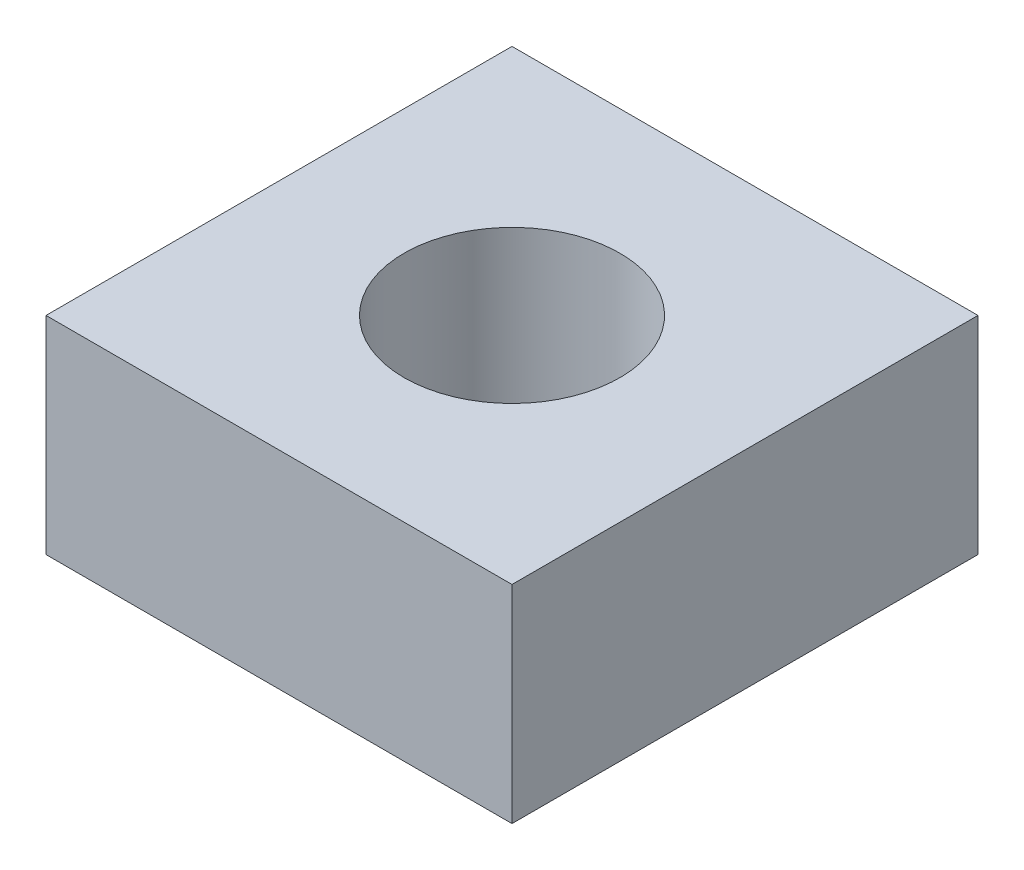
ISO-10303-21;
HEADER;
FILE_DESCRIPTION(('STEP AP214'),'2;1');
FILE_NAME('part.step','',(''),(''),'','','');
FILE_SCHEMA(('AUTOMOTIVE_DESIGN { 1 0 10303 214 1 1 1 1 }'));
ENDSEC;
DATA;
#1=APPLICATION_CONTEXT('core data for automotive mechanical design processes');
#2=APPLICATION_PROTOCOL_DEFINITION('international standard','automotive_design',2000,#1);
#3=PRODUCT_CONTEXT('',#1,'mechanical');
#4=PRODUCT('Part','Part','',(#3));
#5=PRODUCT_RELATED_PRODUCT_CATEGORY('part','',(#4));
#6=PRODUCT_DEFINITION_FORMATION('','',#4);
#7=PRODUCT_DEFINITION_CONTEXT('part definition',#1,'design');
#8=PRODUCT_DEFINITION('design','',#6,#7);
#9=PRODUCT_DEFINITION_SHAPE('','',#8);
#10=(LENGTH_UNIT() NAMED_UNIT(*) SI_UNIT(.MILLI.,.METRE.));
#11=(NAMED_UNIT(*) PLANE_ANGLE_UNIT() SI_UNIT($,.RADIAN.));
#12=(NAMED_UNIT(*) SI_UNIT($,.STERADIAN.) SOLID_ANGLE_UNIT());
#13=UNCERTAINTY_MEASURE_WITH_UNIT(LENGTH_MEASURE(1.E-05),#10,'distance_accuracy_value','');
#14=(GEOMETRIC_REPRESENTATION_CONTEXT(3) GLOBAL_UNCERTAINTY_ASSIGNED_CONTEXT((#13)) GLOBAL_UNIT_ASSIGNED_CONTEXT((#10,
#11,#12)) REPRESENTATION_CONTEXT('',''));
#15=CARTESIAN_POINT('',(0.,0.,0.));
#16=DIRECTION('',(0.,0.,1.));
#17=DIRECTION('',(1.,0.,0.));
#18=AXIS2_PLACEMENT_3D('',#15,#16,#17);
#19=CARTESIAN_POINT('',(2.7,2.40000000000004,2.7));
#20=DIRECTION('',(-0.999999999999999,0.,0.));
#21=DIRECTION('',(0.,0.,0.999999999999999));
#22=AXIS2_PLACEMENT_3D('',#19,#20,#21);
#23=PLANE('',#22);
#24=DIRECTION('',(0.,0.,-0.999999999999999));
#25=VECTOR('',#24,1.);
#26=CARTESIAN_POINT('',(2.7,0.,2.69999999999999));
#27=LINE('',#26,#25);
#28=CARTESIAN_POINT('',(2.7,0.,2.69999999999999));
#29=VERTEX_POINT('',#28);
#30=CARTESIAN_POINT('',(2.7,0.,-2.7));
#31=VERTEX_POINT('',#30);
#32=EDGE_CURVE('E117',#29,#31,#27,.T.);
#33=ORIENTED_EDGE('',*,*,#32,.T.);
#34=DIRECTION('',(0.,-1.,0.));
#35=VECTOR('',#34,1.);
#36=CARTESIAN_POINT('',(2.7,2.40000000000005,-2.70000000000001));
#37=LINE('',#36,#35);
#38=CARTESIAN_POINT('',(2.7,2.40000000000005,-2.70000000000001));
#39=VERTEX_POINT('',#38);
#40=EDGE_CURVE('E13',#39,#31,#37,.T.);
#41=ORIENTED_EDGE('',*,*,#40,.F.);
#42=DIRECTION('',(0.,0.,-0.999999999999999));
#43=VECTOR('',#42,1.);
#44=CARTESIAN_POINT('',(2.7,2.40000000000004,2.7));
#45=LINE('',#44,#43);
#46=CARTESIAN_POINT('',(2.7,2.40000000000004,2.7));
#47=VERTEX_POINT('',#46);
#48=EDGE_CURVE('E105',#47,#39,#45,.T.);
#49=ORIENTED_EDGE('',*,*,#48,.F.);
#50=DIRECTION('',(0.,-1.,0.));
#51=VECTOR('',#50,1.);
#52=CARTESIAN_POINT('',(2.7,2.40000000000004,2.7));
#53=LINE('',#52,#51);
#54=EDGE_CURVE('E113',#47,#29,#53,.T.);
#55=ORIENTED_EDGE('',*,*,#54,.T.);
#56=EDGE_LOOP('',(#33,#41,#49,#55));
#57=FACE_BOUND('',#56,.T.);
#58=ADVANCED_FACE('F54',(#57),#23,.F.);
#59=CARTESIAN_POINT('',(-2.7,2.4,-2.7));
#60=DIRECTION('',(0.,0.,0.999999999999999));
#61=DIRECTION('',(0.999999999999999,0.,0.));
#62=AXIS2_PLACEMENT_3D('',#59,#60,#61);
#63=PLANE('',#62);
#64=DIRECTION('',(-0.999999999999999,0.,0.));
#65=VECTOR('',#64,1.);
#66=CARTESIAN_POINT('',(-2.7,0.,-2.7));
#67=LINE('',#66,#65);
#68=CARTESIAN_POINT('',(-2.7,0.,-2.7));
#69=VERTEX_POINT('',#68);
#70=EDGE_CURVE('E109',#31,#69,#67,.T.);
#71=ORIENTED_EDGE('',*,*,#70,.T.);
#72=DIRECTION('',(0.,-1.,0.));
#73=VECTOR('',#72,1.);
#74=CARTESIAN_POINT('',(-2.7,2.4,-2.7));
#75=LINE('',#74,#73);
#76=CARTESIAN_POINT('',(-2.7,2.4,-2.7));
#77=VERTEX_POINT('',#76);
#78=EDGE_CURVE('E62',#77,#69,#75,.T.);
#79=ORIENTED_EDGE('',*,*,#78,.F.);
#80=DIRECTION('',(-0.999999999999999,0.,0.));
#81=VECTOR('',#80,1.);
#82=CARTESIAN_POINT('',(-2.7,2.4,-2.7));
#83=LINE('',#82,#81);
#84=EDGE_CURVE('E100',#39,#77,#83,.T.);
#85=ORIENTED_EDGE('',*,*,#84,.F.);
#86=ORIENTED_EDGE('',*,*,#40,.T.);
#87=EDGE_LOOP('',(#71,#79,#85,#86));
#88=FACE_BOUND('',#87,.T.);
#89=ADVANCED_FACE('F108',(#88),#63,.F.);
#90=CARTESIAN_POINT('',(-2.7,2.4,2.7));
#91=DIRECTION('',(0.999999999999999,0.,0.));
#92=DIRECTION('',(0.,0.,-0.999999999999999));
#93=AXIS2_PLACEMENT_3D('',#90,#91,#92);
#94=PLANE('',#93);
#95=DIRECTION('',(0.,0.,0.999999999999999));
#96=VECTOR('',#95,1.);
#97=CARTESIAN_POINT('',(-2.7,0.,2.69999999999999));
#98=LINE('',#97,#96);
#99=CARTESIAN_POINT('',(-2.7,0.,2.69999999999999));
#100=VERTEX_POINT('',#99);
#101=EDGE_CURVE('E87',#69,#100,#98,.T.);
#102=ORIENTED_EDGE('',*,*,#101,.T.);
#103=DIRECTION('',(0.,-1.,0.));
#104=VECTOR('',#103,1.);
#105=CARTESIAN_POINT('',(-2.7,2.4,2.7));
#106=LINE('',#105,#104);
#107=CARTESIAN_POINT('',(-2.7,2.4,2.7));
#108=VERTEX_POINT('',#107);
#109=EDGE_CURVE('E110',#108,#100,#106,.T.);
#110=ORIENTED_EDGE('',*,*,#109,.F.);
#111=DIRECTION('',(0.,0.,0.999999999999999));
#112=VECTOR('',#111,1.);
#113=CARTESIAN_POINT('',(-2.7,2.4,2.7));
#114=LINE('',#113,#112);
#115=EDGE_CURVE('E103',#77,#108,#114,.T.);
#116=ORIENTED_EDGE('',*,*,#115,.F.);
#117=ORIENTED_EDGE('',*,*,#78,.T.);
#118=EDGE_LOOP('',(#102,#110,#116,#117));
#119=FACE_BOUND('',#118,.T.);
#120=ADVANCED_FACE('F111',(#119),#94,.F.);
#121=CARTESIAN_POINT('',(-2.7,2.4,2.7));
#122=DIRECTION('',(0.,0.,-0.999999999999999));
#123=DIRECTION('',(-0.999999999999999,0.,0.));
#124=AXIS2_PLACEMENT_3D('',#121,#122,#123);
#125=PLANE('',#124);
#126=DIRECTION('',(0.999999999999999,0.,0.));
#127=VECTOR('',#126,1.);
#128=CARTESIAN_POINT('',(-2.7,0.,2.69999999999999));
#129=LINE('',#128,#127);
#130=EDGE_CURVE('E93',#100,#29,#129,.T.);
#131=ORIENTED_EDGE('',*,*,#130,.T.);
#132=ORIENTED_EDGE('',*,*,#54,.F.);
#133=DIRECTION('',(0.999999999999999,0.,0.));
#134=VECTOR('',#133,1.);
#135=CARTESIAN_POINT('',(-2.7,2.4,2.7));
#136=LINE('',#135,#134);
#137=EDGE_CURVE('E70',#108,#47,#136,.T.);
#138=ORIENTED_EDGE('',*,*,#137,.F.);
#139=ORIENTED_EDGE('',*,*,#109,.T.);
#140=EDGE_LOOP('',(#131,#132,#138,#139));
#141=FACE_BOUND('',#140,.T.);
#142=ADVANCED_FACE('F125',(#141),#125,.F.);
#143=CARTESIAN_POINT('',(0.,2.4,0.));
#144=DIRECTION('',(0.,-1.,0.));
#145=DIRECTION('',(0.,0.,-0.999999999999999));
#146=AXIS2_PLACEMENT_3D('',#143,#144,#145);
#147=PLANE('',#146);
#148=CARTESIAN_POINT('',(0.,2.4,0.));
#149=DIRECTION('',(0.,1.,0.));
#150=DIRECTION('',(0.,0.,0.999999999999999));
#151=AXIS2_PLACEMENT_3D('',#148,#149,#150);
#152=CIRCLE('',#151,1.24999999999999);
#153=CARTESIAN_POINT('',(0.,2.4,1.24999999999999));
#154=VERTEX_POINT('',#153);
#155=EDGE_CURVE('E133',#154,#154,#152,.T.);
#156=ORIENTED_EDGE('',*,*,#155,.F.);
#157=EDGE_LOOP('',(#156));
#158=FACE_BOUND('',#157,.T.);
#159=ORIENTED_EDGE('',*,*,#48,.T.);
#160=ORIENTED_EDGE('',*,*,#84,.T.);
#161=ORIENTED_EDGE('',*,*,#115,.T.);
#162=ORIENTED_EDGE('',*,*,#137,.T.);
#163=EDGE_LOOP('',(#159,#160,#161,#162));
#164=FACE_BOUND('',#163,.T.);
#165=ADVANCED_FACE('F101',(#158,#164),#147,.F.);
#166=CARTESIAN_POINT('',(0.,0.,0.));
#167=DIRECTION('',(0.,-1.,0.));
#168=DIRECTION('',(0.,0.,-0.999999999999999));
#169=AXIS2_PLACEMENT_3D('',#166,#167,#168);
#170=PLANE('',#169);
#171=CARTESIAN_POINT('',(0.,0.,0.));
#172=DIRECTION('',(0.,1.,0.));
#173=DIRECTION('',(0.,0.,0.999999999999999));
#174=AXIS2_PLACEMENT_3D('',#171,#172,#173);
#175=CIRCLE('',#174,1.25);
#176=CARTESIAN_POINT('',(0.,0.,1.24999999999999));
#177=VERTEX_POINT('',#176);
#178=EDGE_CURVE('E120',#177,#177,#175,.T.);
#179=ORIENTED_EDGE('',*,*,#178,.T.);
#180=EDGE_LOOP('',(#179));
#181=FACE_BOUND('',#180,.T.);
#182=ORIENTED_EDGE('',*,*,#32,.F.);
#183=ORIENTED_EDGE('',*,*,#130,.F.);
#184=ORIENTED_EDGE('',*,*,#101,.F.);
#185=ORIENTED_EDGE('',*,*,#70,.F.);
#186=EDGE_LOOP('',(#182,#183,#184,#185));
#187=FACE_BOUND('',#186,.T.);
#188=ADVANCED_FACE('F128',(#181,#187),#170,.T.);
#189=CARTESIAN_POINT('',(0.,2.4,0.));
#190=DIRECTION('',(0.,1.,0.));
#191=DIRECTION('',(0.,0.,0.999999999999999));
#192=AXIS2_PLACEMENT_3D('',#189,#190,#191);
#193=CYLINDRICAL_SURFACE('',#192,1.24999999999999);
#194=ORIENTED_EDGE('',*,*,#178,.F.);
#195=EDGE_LOOP('',(#194));
#196=FACE_BOUND('',#195,.T.);
#197=ORIENTED_EDGE('',*,*,#155,.T.);
#198=EDGE_LOOP('',(#197));
#199=FACE_BOUND('',#198,.T.);
#200=ADVANCED_FACE('F137',(#196,#199),#193,.F.);
#201=CLOSED_SHELL('',(#58,#89,#120,#142,#165,#188,#200));
#202=MANIFOLD_SOLID_BREP('B2',#201);
#203=ADVANCED_BREP_SHAPE_REPRESENTATION('',(#18,#202),#14);
#204=SHAPE_DEFINITION_REPRESENTATION(#9,#203);
ENDSEC;
END-ISO-10303-21;
